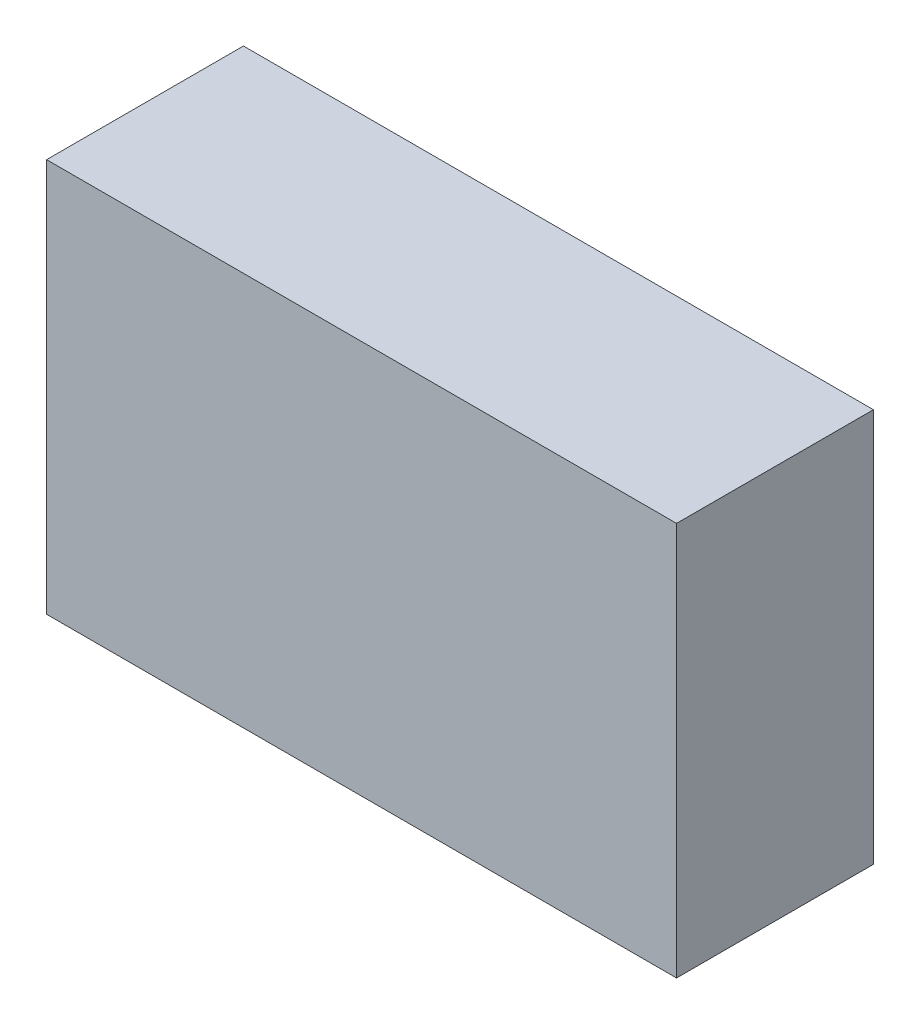
ISO-10303-21;
HEADER;
FILE_DESCRIPTION(('STEP AP214'),'2;1');
FILE_NAME('part.step','',(''),(''),'','','');
FILE_SCHEMA(('AUTOMOTIVE_DESIGN { 1 0 10303 214 1 1 1 1 }'));
ENDSEC;
DATA;
#1=APPLICATION_CONTEXT('core data for automotive mechanical design processes');
#2=APPLICATION_PROTOCOL_DEFINITION('international standard','automotive_design',2000,#1);
#3=PRODUCT_CONTEXT('',#1,'mechanical');
#4=PRODUCT('Part','Part','',(#3));
#5=PRODUCT_RELATED_PRODUCT_CATEGORY('part','',(#4));
#6=PRODUCT_DEFINITION_FORMATION('','',#4);
#7=PRODUCT_DEFINITION_CONTEXT('part definition',#1,'design');
#8=PRODUCT_DEFINITION('design','',#6,#7);
#9=PRODUCT_DEFINITION_SHAPE('','',#8);
#10=(LENGTH_UNIT() NAMED_UNIT(*) SI_UNIT(.MILLI.,.METRE.));
#11=(NAMED_UNIT(*) PLANE_ANGLE_UNIT() SI_UNIT($,.RADIAN.));
#12=(NAMED_UNIT(*) SI_UNIT($,.STERADIAN.) SOLID_ANGLE_UNIT());
#13=UNCERTAINTY_MEASURE_WITH_UNIT(LENGTH_MEASURE(1.E-05),#10,'distance_accuracy_value','');
#14=(GEOMETRIC_REPRESENTATION_CONTEXT(3) GLOBAL_UNCERTAINTY_ASSIGNED_CONTEXT((#13)) GLOBAL_UNIT_ASSIGNED_CONTEXT((#10,
#11,#12)) REPRESENTATION_CONTEXT('',''));
#15=CARTESIAN_POINT('',(0.,0.,0.));
#16=DIRECTION('',(0.,0.,1.));
#17=DIRECTION('',(1.,0.,0.));
#18=AXIS2_PLACEMENT_3D('',#15,#16,#17);
#19=CARTESIAN_POINT('',(1.016,0.635,0.635));
#20=DIRECTION('',(0.,0.,-1.));
#21=DIRECTION('',(-1.,0.,0.));
#22=AXIS2_PLACEMENT_3D('',#19,#20,#21);
#23=PLANE('',#22);
#24=DIRECTION('',(0.,1.,0.));
#25=VECTOR('',#24,1.);
#26=CARTESIAN_POINT('',(-1.016,0.635,0.635));
#27=LINE('',#26,#25);
#28=CARTESIAN_POINT('',(-1.016,0.635,0.635));
#29=VERTEX_POINT('',#28);
#30=CARTESIAN_POINT('',(-1.016,-0.635,0.635));
#31=VERTEX_POINT('',#30);
#32=EDGE_CURVE('E55',#29,#31,#27,.F.);
#33=ORIENTED_EDGE('',*,*,#32,.T.);
#34=DIRECTION('',(1.,0.,0.));
#35=VECTOR('',#34,1.);
#36=CARTESIAN_POINT('',(-1.016,-0.635,0.635));
#37=LINE('',#36,#35);
#38=CARTESIAN_POINT('',(1.016,-0.635,0.635));
#39=VERTEX_POINT('',#38);
#40=EDGE_CURVE('E57',#31,#39,#37,.T.);
#41=ORIENTED_EDGE('',*,*,#40,.T.);
#42=DIRECTION('',(0.,1.,0.));
#43=VECTOR('',#42,1.);
#44=CARTESIAN_POINT('',(1.016,-0.635,0.635));
#45=LINE('',#44,#43);
#46=CARTESIAN_POINT('',(1.016,0.635,0.635));
#47=VERTEX_POINT('',#46);
#48=EDGE_CURVE('E20',#39,#47,#45,.T.);
#49=ORIENTED_EDGE('',*,*,#48,.T.);
#50=DIRECTION('',(1.,0.,0.));
#51=VECTOR('',#50,1.);
#52=CARTESIAN_POINT('',(1.016,0.635,0.635));
#53=LINE('',#52,#51);
#54=EDGE_CURVE('E80',#47,#29,#53,.F.);
#55=ORIENTED_EDGE('',*,*,#54,.T.);
#56=EDGE_LOOP('',(#33,#41,#49,#55));
#57=FACE_BOUND('',#56,.T.);
#58=ADVANCED_FACE('F17',(#57),#23,.F.);
#59=CARTESIAN_POINT('',(1.016,-0.635,0.));
#60=DIRECTION('',(-1.,0.,0.));
#61=DIRECTION('',(0.,0.,1.));
#62=AXIS2_PLACEMENT_3D('',#59,#60,#61);
#63=PLANE('',#62);
#64=DIRECTION('',(0.,0.,-1.));
#65=VECTOR('',#64,1.);
#66=CARTESIAN_POINT('',(1.016,0.635,0.));
#67=LINE('',#66,#65);
#68=CARTESIAN_POINT('',(1.016,0.635,0.));
#69=VERTEX_POINT('',#68);
#70=EDGE_CURVE('E68',#69,#47,#67,.F.);
#71=ORIENTED_EDGE('',*,*,#70,.T.);
#72=ORIENTED_EDGE('',*,*,#48,.F.);
#73=DIRECTION('',(0.,0.,1.));
#74=VECTOR('',#73,1.);
#75=CARTESIAN_POINT('',(1.016,-0.635,0.));
#76=LINE('',#75,#74);
#77=CARTESIAN_POINT('',(1.016,-0.635,0.));
#78=VERTEX_POINT('',#77);
#79=EDGE_CURVE('E63',#39,#78,#76,.F.);
#80=ORIENTED_EDGE('',*,*,#79,.T.);
#81=DIRECTION('',(0.,1.,0.));
#82=VECTOR('',#81,1.);
#83=CARTESIAN_POINT('',(1.016,0.635,0.));
#84=LINE('',#83,#82);
#85=EDGE_CURVE('E83',#69,#78,#84,.F.);
#86=ORIENTED_EDGE('',*,*,#85,.F.);
#87=EDGE_LOOP('',(#71,#72,#80,#86));
#88=FACE_BOUND('',#87,.T.);
#89=ADVANCED_FACE('F65',(#88),#63,.F.);
#90=CARTESIAN_POINT('',(-1.016,-0.635,0.));
#91=DIRECTION('',(0.,1.,0.));
#92=DIRECTION('',(0.,0.,1.));
#93=AXIS2_PLACEMENT_3D('',#90,#91,#92);
#94=PLANE('',#93);
#95=ORIENTED_EDGE('',*,*,#79,.F.);
#96=ORIENTED_EDGE('',*,*,#40,.F.);
#97=DIRECTION('',(0.,0.,-1.));
#98=VECTOR('',#97,1.);
#99=CARTESIAN_POINT('',(-1.016,-0.635,0.));
#100=LINE('',#99,#98);
#101=CARTESIAN_POINT('',(-1.016,-0.635,0.));
#102=VERTEX_POINT('',#101);
#103=EDGE_CURVE('E75',#31,#102,#100,.T.);
#104=ORIENTED_EDGE('',*,*,#103,.T.);
#105=DIRECTION('',(-1.,0.,0.));
#106=VECTOR('',#105,1.);
#107=CARTESIAN_POINT('',(1.016,-0.635,0.));
#108=LINE('',#107,#106);
#109=EDGE_CURVE('E72',#78,#102,#108,.T.);
#110=ORIENTED_EDGE('',*,*,#109,.F.);
#111=EDGE_LOOP('',(#95,#96,#104,#110));
#112=FACE_BOUND('',#111,.T.);
#113=ADVANCED_FACE('F70',(#112),#94,.F.);
#114=CARTESIAN_POINT('',(-1.016,0.635,0.));
#115=DIRECTION('',(1.,0.,0.));
#116=DIRECTION('',(0.,0.,-1.));
#117=AXIS2_PLACEMENT_3D('',#114,#115,#116);
#118=PLANE('',#117);
#119=ORIENTED_EDGE('',*,*,#103,.F.);
#120=ORIENTED_EDGE('',*,*,#32,.F.);
#121=DIRECTION('',(0.,0.,-1.));
#122=VECTOR('',#121,1.);
#123=CARTESIAN_POINT('',(-1.016,0.635,0.));
#124=LINE('',#123,#122);
#125=CARTESIAN_POINT('',(-1.016,0.635,0.));
#126=VERTEX_POINT('',#125);
#127=EDGE_CURVE('E35',#29,#126,#124,.T.);
#128=ORIENTED_EDGE('',*,*,#127,.T.);
#129=DIRECTION('',(0.,1.,0.));
#130=VECTOR('',#129,1.);
#131=CARTESIAN_POINT('',(-1.016,0.635,0.));
#132=LINE('',#131,#130);
#133=EDGE_CURVE('E26',#102,#126,#132,.T.);
#134=ORIENTED_EDGE('',*,*,#133,.F.);
#135=EDGE_LOOP('',(#119,#120,#128,#134));
#136=FACE_BOUND('',#135,.T.);
#137=ADVANCED_FACE('F89',(#136),#118,.F.);
#138=CARTESIAN_POINT('',(1.016,0.635,0.));
#139=DIRECTION('',(0.,-1.,0.));
#140=DIRECTION('',(0.,0.,-1.));
#141=AXIS2_PLACEMENT_3D('',#138,#139,#140);
#142=PLANE('',#141);
#143=ORIENTED_EDGE('',*,*,#127,.F.);
#144=ORIENTED_EDGE('',*,*,#54,.F.);
#145=ORIENTED_EDGE('',*,*,#70,.F.);
#146=DIRECTION('',(-1.,0.,0.));
#147=VECTOR('',#146,1.);
#148=CARTESIAN_POINT('',(1.016,0.635,0.));
#149=LINE('',#148,#147);
#150=EDGE_CURVE('E11',#126,#69,#149,.F.);
#151=ORIENTED_EDGE('',*,*,#150,.F.);
#152=EDGE_LOOP('',(#143,#144,#145,#151));
#153=FACE_BOUND('',#152,.T.);
#154=ADVANCED_FACE('F91',(#153),#142,.F.);
#155=CARTESIAN_POINT('',(1.016,0.635,0.));
#156=DIRECTION('',(0.,0.,-1.));
#157=DIRECTION('',(-1.,0.,0.));
#158=AXIS2_PLACEMENT_3D('',#155,#156,#157);
#159=PLANE('',#158);
#160=ORIENTED_EDGE('',*,*,#133,.T.);
#161=ORIENTED_EDGE('',*,*,#150,.T.);
#162=ORIENTED_EDGE('',*,*,#85,.T.);
#163=ORIENTED_EDGE('',*,*,#109,.T.);
#164=EDGE_LOOP('',(#160,#161,#162,#163));
#165=FACE_BOUND('',#164,.T.);
#166=ADVANCED_FACE('F88',(#165),#159,.T.);
#167=CLOSED_SHELL('',(#58,#89,#113,#137,#154,#166));
#168=MANIFOLD_SOLID_BREP('B1',#167);
#169=ADVANCED_BREP_SHAPE_REPRESENTATION('',(#18,#168),#14);
#170=SHAPE_DEFINITION_REPRESENTATION(#9,#169);
ENDSEC;
END-ISO-10303-21;
